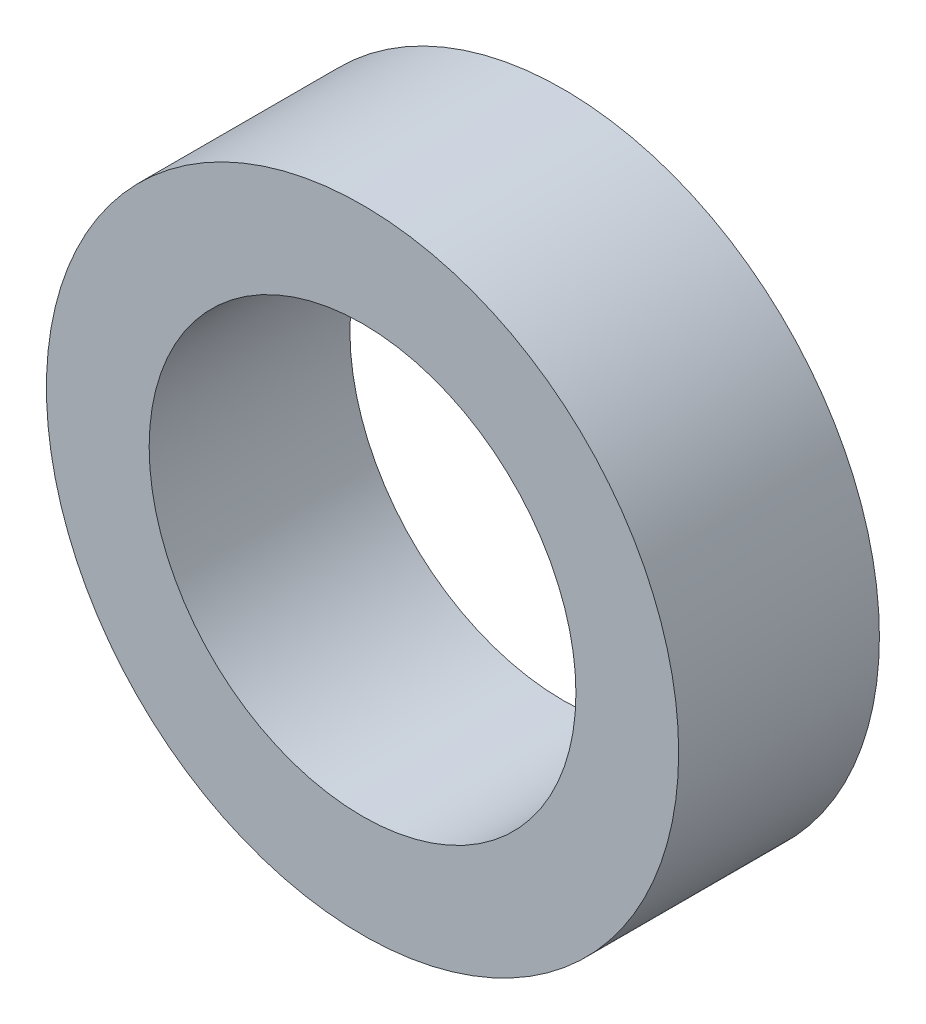
ISO-10303-21;
HEADER;
FILE_DESCRIPTION(('STEP AP214'),'2;1');
FILE_NAME('part.step','',(''),(''),'','','');
FILE_SCHEMA(('AUTOMOTIVE_DESIGN { 1 0 10303 214 1 1 1 1 }'));
ENDSEC;
DATA;
#1=APPLICATION_CONTEXT('core data for automotive mechanical design processes');
#2=APPLICATION_PROTOCOL_DEFINITION('international standard','automotive_design',2000,#1);
#3=PRODUCT_CONTEXT('',#1,'mechanical');
#4=PRODUCT('Part','Part','',(#3));
#5=PRODUCT_RELATED_PRODUCT_CATEGORY('part','',(#4));
#6=PRODUCT_DEFINITION_FORMATION('','',#4);
#7=PRODUCT_DEFINITION_CONTEXT('part definition',#1,'design');
#8=PRODUCT_DEFINITION('design','',#6,#7);
#9=PRODUCT_DEFINITION_SHAPE('','',#8);
#10=(LENGTH_UNIT() NAMED_UNIT(*) SI_UNIT(.MILLI.,.METRE.));
#11=(NAMED_UNIT(*) PLANE_ANGLE_UNIT() SI_UNIT($,.RADIAN.));
#12=(NAMED_UNIT(*) SI_UNIT($,.STERADIAN.) SOLID_ANGLE_UNIT());
#13=UNCERTAINTY_MEASURE_WITH_UNIT(LENGTH_MEASURE(1.E-05),#10,'distance_accuracy_value','');
#14=(GEOMETRIC_REPRESENTATION_CONTEXT(3) GLOBAL_UNCERTAINTY_ASSIGNED_CONTEXT((#13)) GLOBAL_UNIT_ASSIGNED_CONTEXT((#10,
#11,#12)) REPRESENTATION_CONTEXT('',''));
#15=CARTESIAN_POINT('',(0.,0.,0.));
#16=DIRECTION('',(0.,0.,1.));
#17=DIRECTION('',(1.,0.,0.));
#18=AXIS2_PLACEMENT_3D('',#15,#16,#17);
#19=CARTESIAN_POINT('',(0.,0.,2.54));
#20=DIRECTION('',(0.,0.,1.));
#21=DIRECTION('',(1.,0.,0.));
#22=AXIS2_PLACEMENT_3D('',#19,#20,#21);
#23=PLANE('',#22);
#24=CARTESIAN_POINT('',(0.,0.,2.54));
#25=DIRECTION('',(0.,0.,1.));
#26=DIRECTION('',(1.,0.,0.));
#27=AXIS2_PLACEMENT_3D('',#24,#25,#26);
#28=CIRCLE('',#27,4.);
#29=CARTESIAN_POINT('',(4.,0.,2.54));
#30=VERTEX_POINT('',#29);
#31=EDGE_CURVE('E10',#30,#30,#28,.T.);
#32=ORIENTED_EDGE('',*,*,#31,.T.);
#33=EDGE_LOOP('',(#32));
#34=FACE_BOUND('',#33,.T.);
#35=CARTESIAN_POINT('',(0.,0.,2.54));
#36=DIRECTION('',(0.,0.,1.));
#37=DIRECTION('',(1.,0.,0.));
#38=AXIS2_PLACEMENT_3D('',#35,#36,#37);
#39=CIRCLE('',#38,2.7);
#40=CARTESIAN_POINT('',(2.7,0.,2.54));
#41=VERTEX_POINT('',#40);
#42=EDGE_CURVE('E42',#41,#41,#39,.T.);
#43=ORIENTED_EDGE('',*,*,#42,.F.);
#44=EDGE_LOOP('',(#43));
#45=FACE_BOUND('',#44,.T.);
#46=ADVANCED_FACE('F31',(#34,#45),#23,.T.);
#47=CARTESIAN_POINT('',(0.,0.,0.));
#48=DIRECTION('',(0.,0.,1.));
#49=DIRECTION('',(1.,0.,0.));
#50=AXIS2_PLACEMENT_3D('',#47,#48,#49);
#51=PLANE('',#50);
#52=CARTESIAN_POINT('',(0.,0.,0.));
#53=DIRECTION('',(0.,0.,1.));
#54=DIRECTION('',(1.,0.,0.));
#55=AXIS2_PLACEMENT_3D('',#52,#53,#54);
#56=CIRCLE('',#55,4.);
#57=CARTESIAN_POINT('',(4.,0.,0.));
#58=VERTEX_POINT('',#57);
#59=EDGE_CURVE('E35',#58,#58,#56,.T.);
#60=ORIENTED_EDGE('',*,*,#59,.F.);
#61=EDGE_LOOP('',(#60));
#62=FACE_BOUND('',#61,.T.);
#63=CARTESIAN_POINT('',(0.,0.,0.));
#64=DIRECTION('',(0.,0.,1.));
#65=DIRECTION('',(1.,0.,0.));
#66=AXIS2_PLACEMENT_3D('',#63,#64,#65);
#67=CIRCLE('',#66,2.7);
#68=CARTESIAN_POINT('',(2.7,0.,0.));
#69=VERTEX_POINT('',#68);
#70=EDGE_CURVE('E44',#69,#69,#67,.T.);
#71=ORIENTED_EDGE('',*,*,#70,.T.);
#72=EDGE_LOOP('',(#71));
#73=FACE_BOUND('',#72,.T.);
#74=ADVANCED_FACE('F54',(#62,#73),#51,.F.);
#75=CARTESIAN_POINT('',(0.,0.,2.54));
#76=DIRECTION('',(0.,0.,-1.));
#77=DIRECTION('',(-1.,0.,0.));
#78=AXIS2_PLACEMENT_3D('',#75,#76,#77);
#79=CYLINDRICAL_SURFACE('',#78,4.);
#80=ORIENTED_EDGE('',*,*,#31,.F.);
#81=EDGE_LOOP('',(#80));
#82=FACE_BOUND('',#81,.T.);
#83=ORIENTED_EDGE('',*,*,#59,.T.);
#84=EDGE_LOOP('',(#83));
#85=FACE_BOUND('',#84,.T.);
#86=ADVANCED_FACE('F33',(#82,#85),#79,.T.);
#87=CARTESIAN_POINT('',(0.,0.,2.54));
#88=DIRECTION('',(0.,0.,-1.));
#89=DIRECTION('',(-1.,0.,0.));
#90=AXIS2_PLACEMENT_3D('',#87,#88,#89);
#91=CYLINDRICAL_SURFACE('',#90,2.7);
#92=ORIENTED_EDGE('',*,*,#42,.T.);
#93=EDGE_LOOP('',(#92));
#94=FACE_BOUND('',#93,.T.);
#95=ORIENTED_EDGE('',*,*,#70,.F.);
#96=EDGE_LOOP('',(#95));
#97=FACE_BOUND('',#96,.T.);
#98=ADVANCED_FACE('F50',(#94,#97),#91,.F.);
#99=CLOSED_SHELL('',(#46,#74,#86,#98));
#100=MANIFOLD_SOLID_BREP('B2',#99);
#101=ADVANCED_BREP_SHAPE_REPRESENTATION('',(#18,#100),#14);
#102=SHAPE_DEFINITION_REPRESENTATION(#9,#101);
ENDSEC;
END-ISO-10303-21;
